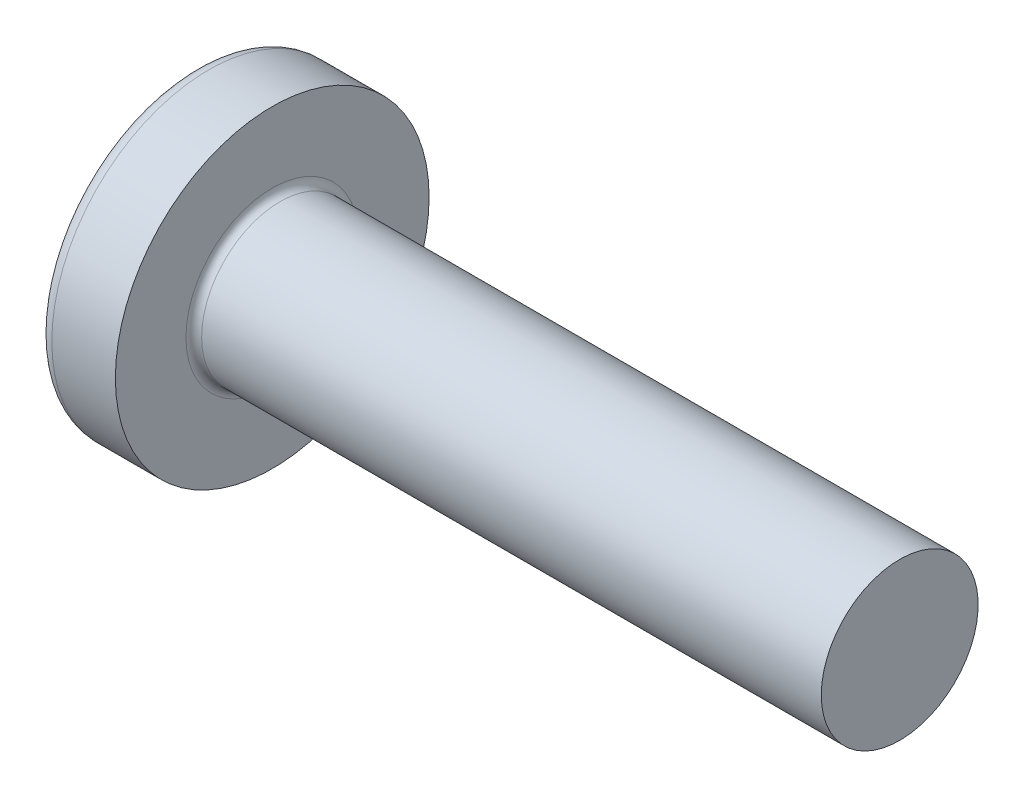
ISO-10303-21;
HEADER;
FILE_DESCRIPTION(('STEP AP214'),'2;1');
FILE_NAME('part.step','',(''),(''),'','','');
FILE_SCHEMA(('AUTOMOTIVE_DESIGN { 1 0 10303 214 1 1 1 1 }'));
ENDSEC;
DATA;
#1=APPLICATION_CONTEXT('core data for automotive mechanical design processes');
#2=APPLICATION_PROTOCOL_DEFINITION('international standard','automotive_design',2000,#1);
#3=PRODUCT_CONTEXT('',#1,'mechanical');
#4=PRODUCT('Part','Part','',(#3));
#5=PRODUCT_RELATED_PRODUCT_CATEGORY('part','',(#4));
#6=PRODUCT_DEFINITION_FORMATION('','',#4);
#7=PRODUCT_DEFINITION_CONTEXT('part definition',#1,'design');
#8=PRODUCT_DEFINITION('design','',#6,#7);
#9=PRODUCT_DEFINITION_SHAPE('','',#8);
#10=(LENGTH_UNIT() NAMED_UNIT(*) SI_UNIT(.MILLI.,.METRE.));
#11=(NAMED_UNIT(*) PLANE_ANGLE_UNIT() SI_UNIT($,.RADIAN.));
#12=(NAMED_UNIT(*) SI_UNIT($,.STERADIAN.) SOLID_ANGLE_UNIT());
#13=UNCERTAINTY_MEASURE_WITH_UNIT(LENGTH_MEASURE(1.E-05),#10,'distance_accuracy_value','');
#14=(GEOMETRIC_REPRESENTATION_CONTEXT(3) GLOBAL_UNCERTAINTY_ASSIGNED_CONTEXT((#13)) GLOBAL_UNIT_ASSIGNED_CONTEXT((#10,
#11,#12)) REPRESENTATION_CONTEXT('',''));
#15=CARTESIAN_POINT('',(0.,0.,0.));
#16=DIRECTION('',(0.,0.,1.));
#17=DIRECTION('',(1.,0.,0.));
#18=AXIS2_PLACEMENT_3D('',#15,#16,#17);
#19=CARTESIAN_POINT('',(3.2,0.,0.));
#20=DIRECTION('',(-1.,0.,0.));
#21=DIRECTION('',(0.,1.,0.));
#22=AXIS2_PLACEMENT_3D('',#19,#20,#21);
#23=SPHERICAL_SURFACE('',#22,3.2);
#24=CARTESIAN_POINT('',(0.646379599446113,0.,0.));
#25=DIRECTION('',(-1.,0.,0.));
#26=DIRECTION('',(0.,0.,1.));
#27=AXIS2_PLACEMENT_3D('',#24,#25,#26);
#28=CIRCLE('',#27,1.92847682119205);
#29=CARTESIAN_POINT('',(0.646379599446113,0.,1.92847682119205));
#30=VERTEX_POINT('',#29);
#31=EDGE_CURVE('E239',#30,#30,#28,.T.);
#32=ORIENTED_EDGE('',*,*,#31,.T.);
#33=EDGE_LOOP('',(#32));
#34=FACE_BOUND('',#33,.T.);
#35=CARTESIAN_POINT('',(0.0321614467928863,0.,0.));
#36=DIRECTION('',(1.,0.,0.));
#37=DIRECTION('',(0.,0.,-1.));
#38=AXIS2_PLACEMENT_3D('',#35,#36,#37);
#39=CIRCLE('',#38,0.452547125518057);
#40=CARTESIAN_POINT('',(0.0321614467928857,-0.239999999999999,-0.38366508938742));
#41=VERTEX_POINT('',#40);
#42=CARTESIAN_POINT('',(0.0321614467928861,-0.383665089387422,-0.24));
#43=VERTEX_POINT('',#42);
#44=EDGE_CURVE('E375',#41,#43,#39,.F.);
#45=ORIENTED_EDGE('',*,*,#44,.F.);
#46=CARTESIAN_POINT('',(3.2,-0.24,0.));
#47=DIRECTION('',(0.,1.,0.));
#48=DIRECTION('',(0.,0.,1.));
#49=AXIS2_PLACEMENT_3D('',#46,#47,#48);
#50=CIRCLE('',#49,3.19098730802866);
#51=CARTESIAN_POINT('',(0.160076670449441,-0.239999999999996,-0.970188718989376));
#52=VERTEX_POINT('',#51);
#53=EDGE_CURVE('E301',#52,#41,#50,.T.);
#54=ORIENTED_EDGE('',*,*,#53,.F.);
#55=CARTESIAN_POINT('',(2.98218770632418,0.,0.436863890831905));
#56=DIRECTION('',(0.446197800778958,0.,-0.89493436774996));
#57=DIRECTION('',(-0.89493436774996,0.,-0.446197800778958));
#58=AXIS2_PLACEMENT_3D('',#55,#56,#57);
#59=CIRCLE('',#58,3.16254766693103);
#60=CARTESIAN_POINT('',(0.160076670449441,0.240000000000003,-0.970188718989374));
#61=VERTEX_POINT('',#60);
#62=EDGE_CURVE('E273',#52,#61,#59,.T.);
#63=ORIENTED_EDGE('',*,*,#62,.T.);
#64=CARTESIAN_POINT('',(3.2,0.24,0.));
#65=DIRECTION('',(0.,-1.,0.));
#66=DIRECTION('',(0.,0.,-1.));
#67=AXIS2_PLACEMENT_3D('',#64,#65,#66);
#68=CIRCLE('',#67,3.19098730802866);
#69=CARTESIAN_POINT('',(0.0321614467928856,0.240000000000001,-0.383665089387418));
#70=VERTEX_POINT('',#69);
#71=EDGE_CURVE('E328',#70,#61,#68,.T.);
#72=ORIENTED_EDGE('',*,*,#71,.F.);
#73=CARTESIAN_POINT('',(0.0321614467928861,0.38366508938742,-0.24));
#74=VERTEX_POINT('',#73);
#75=EDGE_CURVE('E394',#74,#70,#39,.F.);
#76=ORIENTED_EDGE('',*,*,#75,.F.);
#77=CARTESIAN_POINT('',(3.2,0.,-0.24));
#78=DIRECTION('',(0.,0.,1.));
#79=DIRECTION('',(1.,0.,0.));
#80=AXIS2_PLACEMENT_3D('',#77,#78,#79);
#81=CIRCLE('',#80,3.19098730802866);
#82=CARTESIAN_POINT('',(0.160076670449441,0.970188718989374,-0.24));
#83=VERTEX_POINT('',#82);
#84=EDGE_CURVE('E267',#83,#74,#81,.T.);
#85=ORIENTED_EDGE('',*,*,#84,.F.);
#86=CARTESIAN_POINT('',(2.98218770632419,-0.436863890831905,0.));
#87=DIRECTION('',(0.446197800778958,0.89493436774996,0.));
#88=DIRECTION('',(-0.89493436774996,0.446197800778958,0.));
#89=AXIS2_PLACEMENT_3D('',#86,#87,#88);
#90=CIRCLE('',#89,3.16254766693103);
#91=CARTESIAN_POINT('',(0.160076670449442,0.970188718989374,0.24));
#92=VERTEX_POINT('',#91);
#93=EDGE_CURVE('E270',#83,#92,#90,.T.);
#94=ORIENTED_EDGE('',*,*,#93,.T.);
#95=CARTESIAN_POINT('',(3.2,0.,0.24));
#96=DIRECTION('',(0.,0.,-1.));
#97=DIRECTION('',(0.,1.,0.));
#98=AXIS2_PLACEMENT_3D('',#95,#96,#97);
#99=CIRCLE('',#98,3.19098730802866);
#100=CARTESIAN_POINT('',(0.0321614467928861,0.38366508938742,0.24));
#101=VERTEX_POINT('',#100);
#102=EDGE_CURVE('E263',#101,#92,#99,.T.);
#103=ORIENTED_EDGE('',*,*,#102,.F.);
#104=CARTESIAN_POINT('',(0.0321614467928857,0.239999999999999,0.38366508938742));
#105=VERTEX_POINT('',#104);
#106=EDGE_CURVE('E393',#105,#101,#39,.F.);
#107=ORIENTED_EDGE('',*,*,#106,.F.);
#108=CARTESIAN_POINT('',(0.160076670449441,0.239999999999997,0.970188718989375));
#109=VERTEX_POINT('',#108);
#110=EDGE_CURVE('E283',#109,#105,#68,.T.);
#111=ORIENTED_EDGE('',*,*,#110,.F.);
#112=CARTESIAN_POINT('',(2.98218770632418,0.,-0.436863890831904));
#113=DIRECTION('',(0.446197800778958,0.,0.89493436774996));
#114=DIRECTION('',(0.89493436774996,0.,-0.446197800778958));
#115=AXIS2_PLACEMENT_3D('',#112,#113,#114);
#116=CIRCLE('',#115,3.16254766693103);
#117=CARTESIAN_POINT('',(0.160076670449441,-0.240000000000003,0.970188718989374));
#118=VERTEX_POINT('',#117);
#119=EDGE_CURVE('E50',#109,#118,#116,.T.);
#120=ORIENTED_EDGE('',*,*,#119,.T.);
#121=CARTESIAN_POINT('',(0.0321614467928858,-0.240000000000001,0.383665089387418));
#122=VERTEX_POINT('',#121);
#123=EDGE_CURVE('E280',#122,#118,#50,.T.);
#124=ORIENTED_EDGE('',*,*,#123,.F.);
#125=CARTESIAN_POINT('',(0.0321614467928861,-0.383665089387422,0.24));
#126=VERTEX_POINT('',#125);
#127=EDGE_CURVE('E429',#126,#122,#39,.F.);
#128=ORIENTED_EDGE('',*,*,#127,.F.);
#129=CARTESIAN_POINT('',(0.160076670449441,-0.970188718989375,0.24));
#130=VERTEX_POINT('',#129);
#131=EDGE_CURVE('E264',#130,#126,#99,.T.);
#132=ORIENTED_EDGE('',*,*,#131,.F.);
#133=CARTESIAN_POINT('',(2.98218770632418,0.436863890831904,0.));
#134=DIRECTION('',(0.446197800778958,-0.89493436774996,0.));
#135=DIRECTION('',(0.89493436774996,0.446197800778958,0.));
#136=AXIS2_PLACEMENT_3D('',#133,#134,#135);
#137=CIRCLE('',#136,3.16254766693103);
#138=CARTESIAN_POINT('',(0.160076670449441,-0.970188718989375,-0.24));
#139=VERTEX_POINT('',#138);
#140=EDGE_CURVE('E260',#130,#139,#137,.T.);
#141=ORIENTED_EDGE('',*,*,#140,.T.);
#142=EDGE_CURVE('E65',#43,#139,#81,.T.);
#143=ORIENTED_EDGE('',*,*,#142,.F.);
#144=EDGE_LOOP('',(#45,#54,#63,#72,#76,#85,#94,#103,#107,#111,#120,#124,#128,#132,#141,#143));
#145=FACE_BOUND('',#144,.T.);
#146=ADVANCED_FACE('F37',(#34,#145),#23,.T.);
#147=CARTESIAN_POINT('',(1.42,0.342014140993248,-0.24));
#148=DIRECTION('',(0.,0.,1.));
#149=DIRECTION('',(1.,0.,0.));
#150=AXIS2_PLACEMENT_3D('',#147,#148,#149);
#151=PLANE('',#150);
#152=ORIENTED_EDGE('',*,*,#84,.T.);
#153=CARTESIAN_POINT('',(-0.626811087646333,0.437068483432734,-0.24));
#154=CARTESIAN_POINT('',(-0.489788496188268,0.426133650699674,-0.24));
#155=CARTESIAN_POINT('',(-0.35277275089666,0.415111501640762,-0.24));
#156=CARTESIAN_POINT('',(-0.078757882964478,0.392826208775377,-0.24));
#157=CARTESIAN_POINT('',(0.0582412392502161,0.381563059737591,-0.24));
#158=CARTESIAN_POINT('',(0.332213907654152,0.358729879929546,-0.24));
#159=CARTESIAN_POINT('',(0.469187453856035,0.347159849311357,-0.24));
#160=CARTESIAN_POINT('',(0.743097225439297,0.323608060039765,-0.24));
#161=CARTESIAN_POINT('',(0.880033451350377,0.311626307573655,-0.24));
#162=CARTESIAN_POINT('',(1.12503843743479,0.289667437089413,-0.24));
#163=CARTESIAN_POINT('',(1.23311691792,0.279799173776849,-0.24));
#164=CARTESIAN_POINT('',(1.4492267018282,0.259570129968442,-0.24));
#165=CARTESIAN_POINT('',(1.55725800577256,0.249209355061897,-0.24));
#166=CARTESIAN_POINT('',(1.77325939831777,0.227783788850472,-0.24));
#167=CARTESIAN_POINT('',(1.88122948205844,0.216718947894398,-0.24));
#168=CARTESIAN_POINT('',(2.04309848476113,0.199296215271932,-0.24));
#169=CARTESIAN_POINT('',(2.09704158415864,0.193350927204474,-0.24));
#170=CARTESIAN_POINT('',(2.20488609252136,0.181086542764125,-0.24));
#171=CARTESIAN_POINT('',(2.25878750075649,0.174767439988846,-0.24));
#172=CARTESIAN_POINT('',(2.31266102213859,0.168212174791089,-0.24));
#173=B_SPLINE_CURVE_WITH_KNOTS('',3,(#153,#154,#155,#156,#157,#158,#159,#160,#161,#162,#163,
#164,#165,#166,#167,#168,#169,#170,#171,#172),.UNSPECIFIED.,.F.,.F.,(4,2,2,2,2,2,2,2,2,4),(0.,
0.412374804430943,0.824758569256476,1.23714212973639,1.64951949568622,1.97510284899868,
2.30068250829037,2.62628515317116,2.78909323564388,2.95190410736571),.UNSPECIFIED.);
#174=CARTESIAN_POINT('',(1.42,0.262259890185289,-0.240000000000001));
#175=VERTEX_POINT('',#174);
#176=EDGE_CURVE('E415',#74,#175,#173,.T.);
#177=ORIENTED_EDGE('',*,*,#176,.T.);
#178=DIRECTION('',(0.,1.,0.));
#179=VECTOR('',#178,1.);
#180=CARTESIAN_POINT('',(1.42,-0.342014140993248,-0.24));
#181=LINE('',#180,#179);
#182=CARTESIAN_POINT('',(1.42,0.342014140993248,-0.24));
#183=VERTEX_POINT('',#182);
#184=EDGE_CURVE('E357',#175,#183,#181,.T.);
#185=ORIENTED_EDGE('',*,*,#184,.T.);
#186=DIRECTION('',(0.89493436774996,-0.446197800778958,0.));
#187=VECTOR('',#186,1.);
#188=CARTESIAN_POINT('',(0.,1.05,-0.24));
#189=LINE('',#188,#187);
#190=EDGE_CURVE('E240',#83,#183,#189,.T.);
#191=ORIENTED_EDGE('',*,*,#190,.F.);
#192=EDGE_LOOP('',(#152,#177,#185,#191));
#193=FACE_BOUND('',#192,.T.);
#194=ADVANCED_FACE('F195',(#193),#151,.T.);
#195=CARTESIAN_POINT('',(1.42,-0.342014140993248,-0.24));
#196=VERTEX_POINT('',#195);
#197=CARTESIAN_POINT('',(1.42,-0.262259890185289,-0.240000000000001));
#198=VERTEX_POINT('',#197);
#199=EDGE_CURVE('E248',#196,#198,#181,.T.);
#200=ORIENTED_EDGE('',*,*,#199,.T.);
#201=CARTESIAN_POINT('',(-0.626811087646333,-0.437068483432734,-0.24));
#202=CARTESIAN_POINT('',(-0.489788496188268,-0.426133650699674,-0.24));
#203=CARTESIAN_POINT('',(-0.35277275089666,-0.415111501640762,-0.24));
#204=CARTESIAN_POINT('',(-0.078757882964478,-0.392826208775377,-0.24));
#205=CARTESIAN_POINT('',(0.0582412392502161,-0.381563059737591,-0.24));
#206=CARTESIAN_POINT('',(0.332213907654152,-0.358729879929546,-0.24));
#207=CARTESIAN_POINT('',(0.469187453856035,-0.347159849311357,-0.24));
#208=CARTESIAN_POINT('',(0.743097225439297,-0.323608060039765,-0.24));
#209=CARTESIAN_POINT('',(0.880033451350377,-0.311626307573655,-0.24));
#210=CARTESIAN_POINT('',(1.12503843743479,-0.289667437089413,-0.24));
#211=CARTESIAN_POINT('',(1.23311691792,-0.279799173776849,-0.24));
#212=CARTESIAN_POINT('',(1.4492267018282,-0.259570129968442,-0.24));
#213=CARTESIAN_POINT('',(1.55725800577256,-0.249209355061897,-0.24));
#214=CARTESIAN_POINT('',(1.77325939831777,-0.227783788850472,-0.24));
#215=CARTESIAN_POINT('',(1.88122948205844,-0.216718947894398,-0.24));
#216=CARTESIAN_POINT('',(2.04309848476113,-0.199296215271932,-0.24));
#217=CARTESIAN_POINT('',(2.09704158415864,-0.193350927204474,-0.24));
#218=CARTESIAN_POINT('',(2.20488609252136,-0.181086542764125,-0.24));
#219=CARTESIAN_POINT('',(2.25878750075649,-0.174767439988846,-0.24));
#220=CARTESIAN_POINT('',(2.31266102213859,-0.168212174791089,-0.24));
#221=B_SPLINE_CURVE_WITH_KNOTS('',3,(#201,#202,#203,#204,#205,#206,#207,#208,#209,#210,#211,
#212,#213,#214,#215,#216,#217,#218,#219,#220),.UNSPECIFIED.,.F.,.F.,(4,2,2,2,2,2,2,2,2,4),(0.,
0.412374804430943,0.824758569256476,1.23714212973639,1.64951949568622,1.97510284899868,
2.30068250829037,2.62628515317116,2.78909323564388,2.95190410736571),.UNSPECIFIED.);
#222=EDGE_CURVE('E392',#198,#43,#221,.F.);
#223=ORIENTED_EDGE('',*,*,#222,.T.);
#224=ORIENTED_EDGE('',*,*,#142,.T.);
#225=DIRECTION('',(0.89493436774996,0.446197800778958,0.));
#226=VECTOR('',#225,1.);
#227=CARTESIAN_POINT('',(0.,-1.05,-0.24));
#228=LINE('',#227,#226);
#229=EDGE_CURVE('E331',#139,#196,#228,.T.);
#230=ORIENTED_EDGE('',*,*,#229,.T.);
#231=EDGE_LOOP('',(#200,#223,#224,#230));
#232=FACE_BOUND('',#231,.T.);
#233=ADVANCED_FACE('F201',(#232),#151,.T.);
#234=CARTESIAN_POINT('',(1.42,-0.342014140993248,0.24));
#235=DIRECTION('',(0.,0.,-1.));
#236=DIRECTION('',(0.,1.,0.));
#237=AXIS2_PLACEMENT_3D('',#234,#235,#236);
#238=PLANE('',#237);
#239=DIRECTION('',(0.,-1.,0.));
#240=VECTOR('',#239,1.);
#241=CARTESIAN_POINT('',(1.42,0.342014140993248,0.24));
#242=LINE('',#241,#240);
#243=CARTESIAN_POINT('',(1.42,0.342014140993248,0.24));
#244=VERTEX_POINT('',#243);
#245=CARTESIAN_POINT('',(1.42,0.262259890185289,0.240000000000001));
#246=VERTEX_POINT('',#245);
#247=EDGE_CURVE('E340',#244,#246,#242,.T.);
#248=ORIENTED_EDGE('',*,*,#247,.T.);
#249=CARTESIAN_POINT('',(-0.626811087646333,0.437068483432734,0.24));
#250=CARTESIAN_POINT('',(-0.489788496188268,0.426133650699674,0.24));
#251=CARTESIAN_POINT('',(-0.35277275089666,0.415111501640762,0.24));
#252=CARTESIAN_POINT('',(-0.078757882964478,0.392826208775377,0.24));
#253=CARTESIAN_POINT('',(0.0582412392502161,0.381563059737591,0.24));
#254=CARTESIAN_POINT('',(0.332213907654152,0.358729879929546,0.24));
#255=CARTESIAN_POINT('',(0.469187453856035,0.347159849311357,0.24));
#256=CARTESIAN_POINT('',(0.743097225439297,0.323608060039765,0.24));
#257=CARTESIAN_POINT('',(0.880033451350377,0.311626307573655,0.24));
#258=CARTESIAN_POINT('',(1.12503843743479,0.289667437089413,0.24));
#259=CARTESIAN_POINT('',(1.23311691792,0.279799173776849,0.24));
#260=CARTESIAN_POINT('',(1.4492267018282,0.259570129968442,0.24));
#261=CARTESIAN_POINT('',(1.55725800577256,0.249209355061897,0.24));
#262=CARTESIAN_POINT('',(1.77325939831777,0.227783788850472,0.24));
#263=CARTESIAN_POINT('',(1.88122948205844,0.216718947894398,0.24));
#264=CARTESIAN_POINT('',(2.04309848476113,0.199296215271932,0.24));
#265=CARTESIAN_POINT('',(2.09704158415864,0.193350927204474,0.24));
#266=CARTESIAN_POINT('',(2.20488609252136,0.181086542764125,0.24));
#267=CARTESIAN_POINT('',(2.25878750075649,0.174767439988846,0.24));
#268=CARTESIAN_POINT('',(2.31266102213859,0.168212174791089,0.24));
#269=B_SPLINE_CURVE_WITH_KNOTS('',3,(#249,#250,#251,#252,#253,#254,#255,#256,#257,#258,#259,
#260,#261,#262,#263,#264,#265,#266,#267,#268),.UNSPECIFIED.,.F.,.F.,(4,2,2,2,2,2,2,2,2,4),(0.,
0.412374804430943,0.824758569256476,1.23714212973639,1.64951949568622,1.97510284899868,
2.30068250829037,2.62628515317116,2.78909323564388,2.95190410736571),.UNSPECIFIED.);
#270=EDGE_CURVE('E665',#246,#101,#269,.F.);
#271=ORIENTED_EDGE('',*,*,#270,.T.);
#272=ORIENTED_EDGE('',*,*,#102,.T.);
#273=DIRECTION('',(0.89493436774996,-0.446197800778958,0.));
#274=VECTOR('',#273,1.);
#275=CARTESIAN_POINT('',(0.,1.05,0.24));
#276=LINE('',#275,#274);
#277=EDGE_CURVE('E245',#92,#244,#276,.T.);
#278=ORIENTED_EDGE('',*,*,#277,.T.);
#279=EDGE_LOOP('',(#248,#271,#272,#278));
#280=FACE_BOUND('',#279,.T.);
#281=ADVANCED_FACE('F411',(#280),#238,.T.);
#282=ORIENTED_EDGE('',*,*,#131,.T.);
#283=CARTESIAN_POINT('',(-0.62681108769363,-0.437068483436507,0.24));
#284=CARTESIAN_POINT('',(-0.489788496230297,-0.426133650703048,0.24));
#285=CARTESIAN_POINT('',(-0.352772750933422,-0.415111501643733,0.24));
#286=CARTESIAN_POINT('',(-0.078757882990706,-0.392826208777529,0.24));
#287=CARTESIAN_POINT('',(0.0582412392292549,-0.381563059739326,0.24));
#288=CARTESIAN_POINT('',(0.332213907649304,-0.358729879929962,0.24));
#289=CARTESIAN_POINT('',(0.46918745386203,-0.347159849310859,0.24));
#290=CARTESIAN_POINT('',(0.743097225466975,-0.323608060037368,0.24));
#291=CARTESIAN_POINT('',(0.880033451388893,-0.311626307570274,0.24));
#292=CARTESIAN_POINT('',(1.12503843748414,-0.289667437084935,0.24));
#293=CARTESIAN_POINT('',(1.23311691796934,-0.279799173772307,0.24));
#294=CARTESIAN_POINT('',(1.44922670187753,-0.259570129963748,0.24));
#295=CARTESIAN_POINT('',(1.55725800582188,-0.249209355057115,0.24));
#296=CARTESIAN_POINT('',(1.77325939836707,-0.227783788845471,0.24));
#297=CARTESIAN_POINT('',(1.88122948210773,-0.216718947889267,0.24));
#298=CARTESIAN_POINT('',(2.0430984848104,-0.199296215266543,0.24));
#299=CARTESIAN_POINT('',(2.0970415842079,-0.193350927198989,0.24));
#300=CARTESIAN_POINT('',(2.20488609257059,-0.181086542758414,0.24));
#301=CARTESIAN_POINT('',(2.25878750080571,-0.174767439983005,0.24));
#302=CARTESIAN_POINT('',(2.31266102218779,-0.168212174785095,0.24));
#303=B_SPLINE_CURVE_WITH_KNOTS('',3,(#283,#284,#285,#286,#287,#288,#289,#290,#291,#292,#293,
#294,#295,#296,#297,#298,#299,#300,#301,#302),.UNSPECIFIED.,.F.,.F.,(4,2,2,2,2,2,2,2,2,4),(0.,
0.41237480444679,0.824758569288173,1.23714212980074,1.64951949578321,1.97510284909568,
2.30068250838736,2.62628515326816,2.78909323574088,2.95190410746272),.UNSPECIFIED.);
#304=CARTESIAN_POINT('',(1.42,-0.262259890185289,0.240000000000001));
#305=VERTEX_POINT('',#304);
#306=EDGE_CURVE('E430',#126,#305,#303,.T.);
#307=ORIENTED_EDGE('',*,*,#306,.T.);
#308=CARTESIAN_POINT('',(1.42,-0.342014140993248,0.24));
#309=VERTEX_POINT('',#308);
#310=EDGE_CURVE('E342',#305,#309,#242,.T.);
#311=ORIENTED_EDGE('',*,*,#310,.T.);
#312=DIRECTION('',(0.89493436774996,0.446197800778958,0.));
#313=VECTOR('',#312,1.);
#314=CARTESIAN_POINT('',(0.,-1.05,0.24));
#315=LINE('',#314,#313);
#316=EDGE_CURVE('E333',#130,#309,#315,.T.);
#317=ORIENTED_EDGE('',*,*,#316,.F.);
#318=EDGE_LOOP('',(#282,#307,#311,#317));
#319=FACE_BOUND('',#318,.T.);
#320=ADVANCED_FACE('F521',(#319),#238,.T.);
#321=CARTESIAN_POINT('',(1.42,0.342014140993248,0.24));
#322=DIRECTION('',(0.446197800778958,0.89493436774996,0.));
#323=DIRECTION('',(-0.89493436774996,0.446197800778958,0.));
#324=AXIS2_PLACEMENT_3D('',#321,#322,#323);
#325=PLANE('',#324);
#326=CARTESIAN_POINT('',(2.01772939130752,0.0439972701774458,0.));
#327=DIRECTION('',(0.446197800778958,0.89493436774996,0.));
#328=DIRECTION('',(-0.89493436774996,0.446197800778958,0.));
#329=AXIS2_PLACEMENT_3D('',#326,#327,#328);
#330=ELLIPSE('',#329,0.703057452800713,0.310602024247227);
#331=CARTESIAN_POINT('',(1.42,0.342014140993249,0.0969875113643495));
#332=VERTEX_POINT('',#331);
#333=CARTESIAN_POINT('',(1.42,0.342014140993249,-0.0969875113643495));
#334=VERTEX_POINT('',#333);
#335=EDGE_CURVE('E306',#332,#334,#330,.F.);
#336=ORIENTED_EDGE('',*,*,#335,.F.);
#337=DIRECTION('',(0.,0.,-1.));
#338=VECTOR('',#337,1.);
#339=CARTESIAN_POINT('',(1.42,0.342014140993248,0.24));
#340=LINE('',#339,#338);
#341=EDGE_CURVE('E343',#244,#332,#340,.T.);
#342=ORIENTED_EDGE('',*,*,#341,.F.);
#343=ORIENTED_EDGE('',*,*,#277,.F.);
#344=ORIENTED_EDGE('',*,*,#93,.F.);
#345=ORIENTED_EDGE('',*,*,#190,.T.);
#346=EDGE_CURVE('E345',#334,#183,#340,.T.);
#347=ORIENTED_EDGE('',*,*,#346,.F.);
#348=EDGE_LOOP('',(#336,#342,#343,#344,#345,#347));
#349=FACE_BOUND('',#348,.T.);
#350=ADVANCED_FACE('F409',(#349),#325,.F.);
#351=CARTESIAN_POINT('',(0.,-1.05,-0.24));
#352=DIRECTION('',(0.446197800778958,-0.89493436774996,0.));
#353=DIRECTION('',(0.89493436774996,0.446197800778958,0.));
#354=AXIS2_PLACEMENT_3D('',#351,#352,#353);
#355=PLANE('',#354);
#356=CARTESIAN_POINT('',(2.01772939130752,-0.0439972701774458,0.));
#357=DIRECTION('',(0.446197800778958,-0.89493436774996,0.));
#358=DIRECTION('',(-0.89493436774996,-0.446197800778958,0.));
#359=AXIS2_PLACEMENT_3D('',#356,#357,#358);
#360=ELLIPSE('',#359,0.703057452800713,0.310602024247227);
#361=CARTESIAN_POINT('',(1.42,-0.342014140993249,-0.0969875113643494));
#362=VERTEX_POINT('',#361);
#363=CARTESIAN_POINT('',(1.42,-0.342014140993249,0.0969875113643493));
#364=VERTEX_POINT('',#363);
#365=EDGE_CURVE('E667',#362,#364,#360,.F.);
#366=ORIENTED_EDGE('',*,*,#365,.F.);
#367=DIRECTION('',(0.,0.,1.));
#368=VECTOR('',#367,1.);
#369=CARTESIAN_POINT('',(1.42,-0.342014140993248,-0.24));
#370=LINE('',#369,#368);
#371=EDGE_CURVE('E336',#196,#362,#370,.T.);
#372=ORIENTED_EDGE('',*,*,#371,.F.);
#373=ORIENTED_EDGE('',*,*,#229,.F.);
#374=ORIENTED_EDGE('',*,*,#140,.F.);
#375=ORIENTED_EDGE('',*,*,#316,.T.);
#376=EDGE_CURVE('E339',#364,#309,#370,.T.);
#377=ORIENTED_EDGE('',*,*,#376,.F.);
#378=EDGE_LOOP('',(#366,#372,#373,#374,#375,#377));
#379=FACE_BOUND('',#378,.T.);
#380=ADVANCED_FACE('F508',(#379),#355,.F.);
#381=CARTESIAN_POINT('',(1.42,0.342014140993248,-0.24));
#382=DIRECTION('',(-1.,0.,0.));
#383=DIRECTION('',(0.,0.,1.));
#384=AXIS2_PLACEMENT_3D('',#381,#382,#383);
#385=PLANE('',#384);
#386=DIRECTION('',(0.,1.,0.));
#387=VECTOR('',#386,1.);
#388=CARTESIAN_POINT('',(1.42,-0.240000000000001,0.342014140993247));
#389=LINE('',#388,#387);
#390=CARTESIAN_POINT('',(1.42,-0.240000000000001,0.342014140993247));
#391=VERTEX_POINT('',#390);
#392=CARTESIAN_POINT('',(1.42,-0.0969875113643545,0.342014140993248));
#393=VERTEX_POINT('',#392);
#394=EDGE_CURVE('E321',#391,#393,#389,.T.);
#395=ORIENTED_EDGE('',*,*,#394,.T.);
#396=CARTESIAN_POINT('',(1.42,0.,0.));
#397=DIRECTION('',(-1.,0.,0.));
#398=DIRECTION('',(0.,0.,1.));
#399=AXIS2_PLACEMENT_3D('',#396,#397,#398);
#400=CIRCLE('',#399,0.3555);
#401=CARTESIAN_POINT('',(1.42,-0.240000000000001,0.262259890185289));
#402=VERTEX_POINT('',#401);
#403=EDGE_CURVE('E693',#402,#393,#400,.T.);
#404=ORIENTED_EDGE('',*,*,#403,.F.);
#405=DIRECTION('',(0.,0.,-1.));
#406=VECTOR('',#405,1.);
#407=CARTESIAN_POINT('',(1.42,-0.240000000000001,0.342014140993247));
#408=LINE('',#407,#406);
#409=EDGE_CURVE('E317',#391,#402,#408,.T.);
#410=ORIENTED_EDGE('',*,*,#409,.F.);
#411=EDGE_LOOP('',(#395,#404,#410));
#412=FACE_BOUND('',#411,.T.);
#413=ADVANCED_FACE('F465',(#412),#385,.T.);
#414=ORIENTED_EDGE('',*,*,#310,.F.);
#415=EDGE_CURVE('E698',#364,#305,#400,.T.);
#416=ORIENTED_EDGE('',*,*,#415,.F.);
#417=ORIENTED_EDGE('',*,*,#376,.T.);
#418=EDGE_LOOP('',(#414,#416,#417));
#419=FACE_BOUND('',#418,.T.);
#420=ADVANCED_FACE('F495',(#419),#385,.T.);
#421=ORIENTED_EDGE('',*,*,#371,.T.);
#422=EDGE_CURVE('E386',#198,#362,#400,.T.);
#423=ORIENTED_EDGE('',*,*,#422,.F.);
#424=ORIENTED_EDGE('',*,*,#199,.F.);
#425=EDGE_LOOP('',(#421,#423,#424));
#426=FACE_BOUND('',#425,.T.);
#427=ADVANCED_FACE('F489',(#426),#385,.T.);
#428=CARTESIAN_POINT('',(1.42,-0.239999999999999,-0.262259890185288));
#429=VERTEX_POINT('',#428);
#430=CARTESIAN_POINT('',(1.42,-0.239999999999999,-0.342014140993249));
#431=VERTEX_POINT('',#430);
#432=EDGE_CURVE('E320',#429,#431,#408,.T.);
#433=ORIENTED_EDGE('',*,*,#432,.F.);
#434=CARTESIAN_POINT('',(1.42,-0.0969875113643523,-0.342014140993248));
#435=VERTEX_POINT('',#434);
#436=EDGE_CURVE('E57',#435,#429,#400,.T.);
#437=ORIENTED_EDGE('',*,*,#436,.F.);
#438=DIRECTION('',(0.,-1.,0.));
#439=VECTOR('',#438,1.);
#440=CARTESIAN_POINT('',(1.42,0.240000000000001,-0.342014140993247));
#441=LINE('',#440,#439);
#442=EDGE_CURVE('E316',#435,#431,#441,.T.);
#443=ORIENTED_EDGE('',*,*,#442,.T.);
#444=EDGE_LOOP('',(#433,#437,#443));
#445=FACE_BOUND('',#444,.T.);
#446=ADVANCED_FACE('F381',(#445),#385,.T.);
#447=CARTESIAN_POINT('',(1.42,0.240000000000001,-0.342014140993247));
#448=VERTEX_POINT('',#447);
#449=CARTESIAN_POINT('',(1.42,0.0969875113643547,-0.342014140993248));
#450=VERTEX_POINT('',#449);
#451=EDGE_CURVE('E313',#448,#450,#441,.T.);
#452=ORIENTED_EDGE('',*,*,#451,.T.);
#453=CARTESIAN_POINT('',(1.42,0.240000000000001,-0.262259890185289));
#454=VERTEX_POINT('',#453);
#455=EDGE_CURVE('E385',#454,#450,#400,.T.);
#456=ORIENTED_EDGE('',*,*,#455,.F.);
#457=DIRECTION('',(0.,0.,1.));
#458=VECTOR('',#457,1.);
#459=CARTESIAN_POINT('',(1.42,0.240000000000001,-0.342014140993247));
#460=LINE('',#459,#458);
#461=EDGE_CURVE('E325',#448,#454,#460,.T.);
#462=ORIENTED_EDGE('',*,*,#461,.F.);
#463=EDGE_LOOP('',(#452,#456,#462));
#464=FACE_BOUND('',#463,.T.);
#465=ADVANCED_FACE('F477',(#464),#385,.T.);
#466=ORIENTED_EDGE('',*,*,#184,.F.);
#467=EDGE_CURVE('E682',#334,#175,#400,.T.);
#468=ORIENTED_EDGE('',*,*,#467,.F.);
#469=ORIENTED_EDGE('',*,*,#346,.T.);
#470=EDGE_LOOP('',(#466,#468,#469));
#471=FACE_BOUND('',#470,.T.);
#472=ADVANCED_FACE('F471',(#471),#385,.T.);
#473=ORIENTED_EDGE('',*,*,#341,.T.);
#474=EDGE_CURVE('E684',#246,#332,#400,.T.);
#475=ORIENTED_EDGE('',*,*,#474,.F.);
#476=ORIENTED_EDGE('',*,*,#247,.F.);
#477=EDGE_LOOP('',(#473,#475,#476));
#478=FACE_BOUND('',#477,.T.);
#479=ADVANCED_FACE('F463',(#478),#385,.T.);
#480=CARTESIAN_POINT('',(1.42,0.239999999999999,0.26225989018529));
#481=VERTEX_POINT('',#480);
#482=CARTESIAN_POINT('',(1.42,0.239999999999999,0.342014140993249));
#483=VERTEX_POINT('',#482);
#484=EDGE_CURVE('E298',#481,#483,#460,.T.);
#485=ORIENTED_EDGE('',*,*,#484,.F.);
#486=CARTESIAN_POINT('',(1.42,0.0969875113643521,0.342014140993249));
#487=VERTEX_POINT('',#486);
#488=EDGE_CURVE('E387',#487,#481,#400,.T.);
#489=ORIENTED_EDGE('',*,*,#488,.F.);
#490=EDGE_CURVE('E324',#487,#483,#389,.T.);
#491=ORIENTED_EDGE('',*,*,#490,.T.);
#492=EDGE_LOOP('',(#485,#489,#491));
#493=FACE_BOUND('',#492,.T.);
#494=ADVANCED_FACE('F457',(#493),#385,.T.);
#495=CARTESIAN_POINT('',(1.42,0.239999999999999,0.342014140993249));
#496=DIRECTION('',(0.,-1.,0.));
#497=DIRECTION('',(1.,0.,0.));
#498=AXIS2_PLACEMENT_3D('',#495,#496,#497);
#499=PLANE('',#498);
#500=ORIENTED_EDGE('',*,*,#110,.T.);
#501=CARTESIAN_POINT('',(-0.626811087646333,0.239999999999998,0.437068483432735));
#502=CARTESIAN_POINT('',(-0.489788496188268,0.239999999999999,0.426133650699675));
#503=CARTESIAN_POINT('',(-0.35277275089666,0.239999999999999,0.415111501640762));
#504=CARTESIAN_POINT('',(-0.0787578829644782,0.239999999999999,0.392826208775378));
#505=CARTESIAN_POINT('',(0.0582412392502159,0.239999999999999,0.381563059737592));
#506=CARTESIAN_POINT('',(0.332213907654153,0.239999999999999,0.358729879929547));
#507=CARTESIAN_POINT('',(0.469187453856035,0.239999999999999,0.347159849311358));
#508=CARTESIAN_POINT('',(0.743097225439297,0.239999999999999,0.323608060039766));
#509=CARTESIAN_POINT('',(0.880033451350377,0.239999999999999,0.311626307573656));
#510=CARTESIAN_POINT('',(1.12503843743479,0.239999999999999,0.289667437089414));
#511=CARTESIAN_POINT('',(1.23311691792,0.239999999999999,0.279799173776849));
#512=CARTESIAN_POINT('',(1.4492267018282,0.239999999999999,0.259570129968443));
#513=CARTESIAN_POINT('',(1.55725800577256,0.239999999999999,0.249209355061898));
#514=CARTESIAN_POINT('',(1.77325939831777,0.239999999999999,0.227783788850473));
#515=CARTESIAN_POINT('',(1.88122948205844,0.239999999999999,0.216718947894399));
#516=CARTESIAN_POINT('',(2.04309848476113,0.239999999999999,0.199296215271933));
#517=CARTESIAN_POINT('',(2.09704158415864,0.239999999999999,0.193350927204475));
#518=CARTESIAN_POINT('',(2.20488609252136,0.239999999999999,0.181086542764126));
#519=CARTESIAN_POINT('',(2.25878750075649,0.239999999999999,0.174767439988847));
#520=CARTESIAN_POINT('',(2.31266102213859,0.239999999999999,0.16821217479109));
#521=B_SPLINE_CURVE_WITH_KNOTS('',3,(#501,#502,#503,#504,#505,#506,#507,#508,#509,#510,#511,
#512,#513,#514,#515,#516,#517,#518,#519,#520),.UNSPECIFIED.,.F.,.F.,(4,2,2,2,2,2,2,2,2,4),(0.,
0.412374804430942,0.824758569256476,1.23714212973639,1.64951949568622,1.97510284899868,
2.30068250829037,2.62628515317116,2.78909323564388,2.95190410736571),.UNSPECIFIED.);
#522=EDGE_CURVE('E664',#105,#481,#521,.T.);
#523=ORIENTED_EDGE('',*,*,#522,.T.);
#524=ORIENTED_EDGE('',*,*,#484,.T.);
#525=DIRECTION('',(0.89493436774996,0.,-0.446197800778958));
#526=VECTOR('',#525,1.);
#527=CARTESIAN_POINT('',(0.,0.239999999999996,1.05));
#528=LINE('',#527,#526);
#529=EDGE_CURVE('E291',#109,#483,#528,.T.);
#530=ORIENTED_EDGE('',*,*,#529,.F.);
#531=EDGE_LOOP('',(#500,#523,#524,#530));
#532=FACE_BOUND('',#531,.T.);
#533=ADVANCED_FACE('F295',(#532),#499,.T.);
#534=CARTESIAN_POINT('',(1.42,-0.239999999999999,-0.342014140993249));
#535=DIRECTION('',(0.,1.,0.));
#536=DIRECTION('',(0.,0.,1.));
#537=AXIS2_PLACEMENT_3D('',#534,#535,#536);
#538=PLANE('',#537);
#539=ORIENTED_EDGE('',*,*,#409,.T.);
#540=CARTESIAN_POINT('',(-0.626811087646334,-0.240000000000002,0.437068483432733));
#541=CARTESIAN_POINT('',(-0.489788496188268,-0.240000000000001,0.426133650699673));
#542=CARTESIAN_POINT('',(-0.35277275089666,-0.240000000000001,0.415111501640761));
#543=CARTESIAN_POINT('',(-0.0787578829644779,-0.240000000000001,0.392826208775376));
#544=CARTESIAN_POINT('',(0.0582412392502161,-0.240000000000001,0.38156305973759));
#545=CARTESIAN_POINT('',(0.332213907654152,-0.240000000000001,0.358729879929545));
#546=CARTESIAN_POINT('',(0.469187453856034,-0.240000000000001,0.347159849311357));
#547=CARTESIAN_POINT('',(0.743097225439297,-0.240000000000001,0.323608060039764));
#548=CARTESIAN_POINT('',(0.880033451350377,-0.240000000000001,0.311626307573654));
#549=CARTESIAN_POINT('',(1.12503843743479,-0.240000000000001,0.289667437089413));
#550=CARTESIAN_POINT('',(1.23311691792,-0.240000000000001,0.279799173776848));
#551=CARTESIAN_POINT('',(1.4492267018282,-0.240000000000001,0.259570129968441));
#552=CARTESIAN_POINT('',(1.55725800577256,-0.240000000000001,0.249209355061896));
#553=CARTESIAN_POINT('',(1.77325939831777,-0.240000000000001,0.227783788850472));
#554=CARTESIAN_POINT('',(1.88122948205844,-0.240000000000001,0.216718947894398));
#555=CARTESIAN_POINT('',(2.04309848476113,-0.240000000000001,0.199296215271931));
#556=CARTESIAN_POINT('',(2.09704158415864,-0.240000000000001,0.193350927204474));
#557=CARTESIAN_POINT('',(2.20488609252136,-0.240000000000001,0.181086542764124));
#558=CARTESIAN_POINT('',(2.25878750075649,-0.240000000000001,0.174767439988845));
#559=CARTESIAN_POINT('',(2.31266102213859,-0.240000000000001,0.168212174791088));
#560=B_SPLINE_CURVE_WITH_KNOTS('',3,(#540,#541,#542,#543,#544,#545,#546,#547,#548,#549,#550,
#551,#552,#553,#554,#555,#556,#557,#558,#559),.UNSPECIFIED.,.F.,.F.,(4,2,2,2,2,2,2,2,2,4),(0.,
0.412374804430943,0.824758569256476,1.23714212973639,1.64951949568622,1.97510284899868,
2.30068250829037,2.62628515317116,2.78909323564388,2.95190410736571),.UNSPECIFIED.);
#561=EDGE_CURVE('E423',#402,#122,#560,.F.);
#562=ORIENTED_EDGE('',*,*,#561,.T.);
#563=ORIENTED_EDGE('',*,*,#123,.T.);
#564=DIRECTION('',(0.89493436774996,0.,-0.446197800778958));
#565=VECTOR('',#564,1.);
#566=CARTESIAN_POINT('',(0.,-0.240000000000004,1.05));
#567=LINE('',#566,#565);
#568=EDGE_CURVE('E293',#118,#391,#567,.T.);
#569=ORIENTED_EDGE('',*,*,#568,.T.);
#570=EDGE_LOOP('',(#539,#562,#563,#569));
#571=FACE_BOUND('',#570,.T.);
#572=ADVANCED_FACE('F230',(#571),#538,.T.);
#573=CARTESIAN_POINT('',(1.42,-0.240000000000001,0.342014140993247));
#574=DIRECTION('',(0.446197800778958,0.,0.89493436774996));
#575=DIRECTION('',(-0.89493436774996,0.,0.446197800778958));
#576=AXIS2_PLACEMENT_3D('',#573,#574,#575);
#577=PLANE('',#576);
#578=CARTESIAN_POINT('',(2.01772939130752,0.,0.0439972701774458));
#579=DIRECTION('',(0.446197800778958,0.,0.89493436774996));
#580=DIRECTION('',(-0.89493436774996,0.,0.446197800778958));
#581=AXIS2_PLACEMENT_3D('',#578,#579,#580);
#582=ELLIPSE('',#581,0.703057452800713,0.310602024247227);
#583=EDGE_CURVE('E421',#393,#487,#582,.F.);
#584=ORIENTED_EDGE('',*,*,#583,.F.);
#585=ORIENTED_EDGE('',*,*,#394,.F.);
#586=ORIENTED_EDGE('',*,*,#568,.F.);
#587=ORIENTED_EDGE('',*,*,#119,.F.);
#588=ORIENTED_EDGE('',*,*,#529,.T.);
#589=ORIENTED_EDGE('',*,*,#490,.F.);
#590=EDGE_LOOP('',(#584,#585,#586,#587,#588,#589));
#591=FACE_BOUND('',#590,.T.);
#592=ADVANCED_FACE('F289',(#591),#577,.F.);
#593=CARTESIAN_POINT('',(0.,0.240000000000004,-1.05));
#594=DIRECTION('',(0.446197800778958,0.,-0.89493436774996));
#595=DIRECTION('',(0.89493436774996,0.,0.446197800778958));
#596=AXIS2_PLACEMENT_3D('',#593,#594,#595);
#597=PLANE('',#596);
#598=CARTESIAN_POINT('',(2.01772939130752,0.,-0.0439972701774458));
#599=DIRECTION('',(0.446197800778958,0.,-0.89493436774996));
#600=DIRECTION('',(-0.89493436774996,0.,-0.446197800778958));
#601=AXIS2_PLACEMENT_3D('',#598,#599,#600);
#602=ELLIPSE('',#601,0.703057452800713,0.310602024247227);
#603=EDGE_CURVE('E379',#450,#435,#602,.F.);
#604=ORIENTED_EDGE('',*,*,#603,.F.);
#605=ORIENTED_EDGE('',*,*,#451,.F.);
#606=DIRECTION('',(0.89493436774996,0.,0.446197800778958));
#607=VECTOR('',#606,1.);
#608=CARTESIAN_POINT('',(0.,0.240000000000004,-1.05));
#609=LINE('',#608,#607);
#610=EDGE_CURVE('E303',#61,#448,#609,.T.);
#611=ORIENTED_EDGE('',*,*,#610,.F.);
#612=ORIENTED_EDGE('',*,*,#62,.F.);
#613=DIRECTION('',(0.89493436774996,0.,0.446197800778958));
#614=VECTOR('',#613,1.);
#615=CARTESIAN_POINT('',(0.,-0.239999999999996,-1.05));
#616=LINE('',#615,#614);
#617=EDGE_CURVE('E310',#52,#431,#616,.T.);
#618=ORIENTED_EDGE('',*,*,#617,.T.);
#619=ORIENTED_EDGE('',*,*,#442,.F.);
#620=EDGE_LOOP('',(#604,#605,#611,#612,#618,#619));
#621=FACE_BOUND('',#620,.T.);
#622=ADVANCED_FACE('F370',(#621),#597,.F.);
#623=ORIENTED_EDGE('',*,*,#461,.T.);
#624=CARTESIAN_POINT('',(-0.62681108769363,0.240000000000001,-0.437068483436506));
#625=CARTESIAN_POINT('',(-0.489788496230297,0.240000000000001,-0.426133650703047));
#626=CARTESIAN_POINT('',(-0.352772750933422,0.240000000000001,-0.415111501643732));
#627=CARTESIAN_POINT('',(-0.0787578829907061,0.240000000000001,-0.392826208777528));
#628=CARTESIAN_POINT('',(0.0582412392292548,0.240000000000001,-0.381563059739325));
#629=CARTESIAN_POINT('',(0.332213907649304,0.240000000000001,-0.358729879929961));
#630=CARTESIAN_POINT('',(0.46918745386203,0.240000000000001,-0.347159849310858));
#631=CARTESIAN_POINT('',(0.743097225466975,0.240000000000001,-0.323608060037367));
#632=CARTESIAN_POINT('',(0.880033451388893,0.240000000000001,-0.311626307570273));
#633=CARTESIAN_POINT('',(1.12503843748414,0.240000000000001,-0.289667437084934));
#634=CARTESIAN_POINT('',(1.23311691796933,0.240000000000001,-0.279799173772306));
#635=CARTESIAN_POINT('',(1.44922670187753,0.240000000000001,-0.259570129963747));
#636=CARTESIAN_POINT('',(1.55725800582188,0.240000000000001,-0.249209355057114));
#637=CARTESIAN_POINT('',(1.77325939836707,0.240000000000001,-0.22778378884547));
#638=CARTESIAN_POINT('',(1.88122948210773,0.240000000000001,-0.216718947889266));
#639=CARTESIAN_POINT('',(2.0430984848104,0.240000000000001,-0.199296215266542));
#640=CARTESIAN_POINT('',(2.0970415842079,0.240000000000001,-0.193350927198988));
#641=CARTESIAN_POINT('',(2.20488609257059,0.240000000000001,-0.181086542758413));
#642=CARTESIAN_POINT('',(2.25878750080571,0.240000000000001,-0.174767439983004));
#643=CARTESIAN_POINT('',(2.31266102218779,0.240000000000001,-0.168212174785094));
#644=B_SPLINE_CURVE_WITH_KNOTS('',3,(#624,#625,#626,#627,#628,#629,#630,#631,#632,#633,#634,
#635,#636,#637,#638,#639,#640,#641,#642,#643),.UNSPECIFIED.,.F.,.F.,(4,2,2,2,2,2,2,2,2,4),(0.,
0.41237480444679,0.824758569288173,1.23714212980074,1.64951949578321,1.97510284909568,
2.30068250838736,2.62628515326816,2.78909323574088,2.95190410746272),.UNSPECIFIED.);
#645=EDGE_CURVE('E366',#454,#70,#644,.F.);
#646=ORIENTED_EDGE('',*,*,#645,.T.);
#647=ORIENTED_EDGE('',*,*,#71,.T.);
#648=ORIENTED_EDGE('',*,*,#610,.T.);
#649=EDGE_LOOP('',(#623,#646,#647,#648));
#650=FACE_BOUND('',#649,.T.);
#651=ADVANCED_FACE('F228',(#650),#499,.T.);
#652=ORIENTED_EDGE('',*,*,#53,.T.);
#653=CARTESIAN_POINT('',(-0.626811087646333,-0.239999999999998,-0.437068483432735));
#654=CARTESIAN_POINT('',(-0.489788496188268,-0.239999999999998,-0.426133650699675));
#655=CARTESIAN_POINT('',(-0.35277275089666,-0.239999999999998,-0.415111501640762));
#656=CARTESIAN_POINT('',(-0.0787578829644779,-0.239999999999998,-0.392826208775378));
#657=CARTESIAN_POINT('',(0.0582412392502162,-0.239999999999999,-0.381563059737592));
#658=CARTESIAN_POINT('',(0.332213907654152,-0.239999999999999,-0.358729879929547));
#659=CARTESIAN_POINT('',(0.469187453856035,-0.239999999999999,-0.347159849311358));
#660=CARTESIAN_POINT('',(0.743097225439297,-0.239999999999999,-0.323608060039766));
#661=CARTESIAN_POINT('',(0.880033451350377,-0.239999999999999,-0.311626307573656));
#662=CARTESIAN_POINT('',(1.12503843743479,-0.239999999999999,-0.289667437089414));
#663=CARTESIAN_POINT('',(1.23311691792,-0.239999999999999,-0.27979917377685));
#664=CARTESIAN_POINT('',(1.4492267018282,-0.239999999999999,-0.259570129968443));
#665=CARTESIAN_POINT('',(1.55725800577256,-0.239999999999999,-0.249209355061898));
#666=CARTESIAN_POINT('',(1.77325939831777,-0.239999999999999,-0.227783788850473));
#667=CARTESIAN_POINT('',(1.88122948205844,-0.239999999999999,-0.216718947894399));
#668=CARTESIAN_POINT('',(2.04309848476113,-0.239999999999999,-0.199296215271933));
#669=CARTESIAN_POINT('',(2.09704158415864,-0.239999999999999,-0.193350927204475));
#670=CARTESIAN_POINT('',(2.20488609252136,-0.239999999999999,-0.181086542764126));
#671=CARTESIAN_POINT('',(2.25878750075649,-0.239999999999999,-0.174767439988847));
#672=CARTESIAN_POINT('',(2.31266102213859,-0.239999999999999,-0.16821217479109));
#673=B_SPLINE_CURVE_WITH_KNOTS('',3,(#653,#654,#655,#656,#657,#658,#659,#660,#661,#662,#663,
#664,#665,#666,#667,#668,#669,#670,#671,#672),.UNSPECIFIED.,.F.,.F.,(4,2,2,2,2,2,2,2,2,4),(0.,
0.412374804430943,0.824758569256476,1.23714212973639,1.64951949568622,1.97510284899868,
2.30068250829037,2.62628515317116,2.78909323564388,2.95190410736571),.UNSPECIFIED.);
#674=EDGE_CURVE('E11',#41,#429,#673,.T.);
#675=ORIENTED_EDGE('',*,*,#674,.T.);
#676=ORIENTED_EDGE('',*,*,#432,.T.);
#677=ORIENTED_EDGE('',*,*,#617,.F.);
#678=EDGE_LOOP('',(#652,#675,#676,#677));
#679=FACE_BOUND('',#678,.T.);
#680=ADVANCED_FACE('F223',(#679),#538,.T.);
#681=CARTESIAN_POINT('',(-25.4,0.,0.));
#682=DIRECTION('',(-1.,0.,0.));
#683=DIRECTION('',(0.,0.,1.));
#684=AXIS2_PLACEMENT_3D('',#681,#682,#683);
#685=CYLINDRICAL_SURFACE('',#684,1.);
#686=CARTESIAN_POINT('',(1.7,0.,0.));
#687=DIRECTION('',(-1.,0.,0.));
#688=DIRECTION('',(0.,0.,1.));
#689=AXIS2_PLACEMENT_3D('',#686,#687,#688);
#690=CIRCLE('',#689,1.);
#691=CARTESIAN_POINT('',(1.7,0.,1.));
#692=VERTEX_POINT('',#691);
#693=EDGE_CURVE('E234',#692,#692,#690,.F.);
#694=ORIENTED_EDGE('',*,*,#693,.T.);
#695=EDGE_LOOP('',(#694));
#696=FACE_BOUND('',#695,.T.);
#697=CARTESIAN_POINT('',(9.6,0.,0.));
#698=DIRECTION('',(-1.,0.,0.));
#699=DIRECTION('',(0.,0.,1.));
#700=AXIS2_PLACEMENT_3D('',#697,#698,#699);
#701=CIRCLE('',#700,1.);
#702=CARTESIAN_POINT('',(9.6,0.,1.));
#703=VERTEX_POINT('',#702);
#704=EDGE_CURVE('E237',#703,#703,#701,.T.);
#705=ORIENTED_EDGE('',*,*,#704,.T.);
#706=EDGE_LOOP('',(#705));
#707=FACE_BOUND('',#706,.T.);
#708=ADVANCED_FACE('F220',(#696,#707),#685,.T.);
#709=CARTESIAN_POINT('',(1.6,1.,0.));
#710=DIRECTION('',(-1.,0.,0.));
#711=DIRECTION('',(0.,0.,1.));
#712=AXIS2_PLACEMENT_3D('',#709,#710,#711);
#713=PLANE('',#712);
#714=CARTESIAN_POINT('',(1.6,0.,0.));
#715=DIRECTION('',(-1.,0.,0.));
#716=DIRECTION('',(0.,0.,1.));
#717=AXIS2_PLACEMENT_3D('',#714,#715,#716);
#718=CIRCLE('',#717,1.1);
#719=CARTESIAN_POINT('',(1.6,0.,1.1));
#720=VERTEX_POINT('',#719);
#721=EDGE_CURVE('E256',#720,#720,#718,.T.);
#722=ORIENTED_EDGE('',*,*,#721,.T.);
#723=EDGE_LOOP('',(#722));
#724=FACE_BOUND('',#723,.T.);
#725=CARTESIAN_POINT('',(1.6,0.,0.));
#726=DIRECTION('',(-1.,0.,0.));
#727=DIRECTION('',(0.,0.,1.));
#728=AXIS2_PLACEMENT_3D('',#725,#726,#727);
#729=CIRCLE('',#728,2.);
#730=CARTESIAN_POINT('',(1.6,0.,2.));
#731=VERTEX_POINT('',#730);
#732=EDGE_CURVE('E253',#731,#731,#729,.T.);
#733=ORIENTED_EDGE('',*,*,#732,.F.);
#734=EDGE_LOOP('',(#733));
#735=FACE_BOUND('',#734,.T.);
#736=ADVANCED_FACE('F217',(#724,#735),#713,.F.);
#737=CARTESIAN_POINT('',(-25.4,0.,0.));
#738=DIRECTION('',(-1.,0.,0.));
#739=DIRECTION('',(0.,0.,1.));
#740=AXIS2_PLACEMENT_3D('',#737,#738,#739);
#741=CYLINDRICAL_SURFACE('',#740,2.);
#742=ORIENTED_EDGE('',*,*,#732,.T.);
#743=EDGE_LOOP('',(#742));
#744=FACE_BOUND('',#743,.T.);
#745=CARTESIAN_POINT('',(0.790020746977271,0.,0.));
#746=DIRECTION('',(-1.,0.,0.));
#747=DIRECTION('',(0.,0.,1.));
#748=AXIS2_PLACEMENT_3D('',#745,#746,#747);
#749=CIRCLE('',#748,2.);
#750=CARTESIAN_POINT('',(0.790020746977271,0.,2.));
#751=VERTEX_POINT('',#750);
#752=EDGE_CURVE('E242',#751,#751,#749,.T.);
#753=ORIENTED_EDGE('',*,*,#752,.F.);
#754=EDGE_LOOP('',(#753));
#755=FACE_BOUND('',#754,.T.);
#756=ADVANCED_FACE('F213',(#744,#755),#741,.T.);
#757=CARTESIAN_POINT('',(0.79002074697727,0.,0.));
#758=DIRECTION('',(-1.,0.,0.));
#759=DIRECTION('',(0.,0.,1.));
#760=AXIS2_PLACEMENT_3D('',#757,#758,#759);
#761=TOROIDAL_SURFACE('',#760,1.82,0.18);
#762=ORIENTED_EDGE('',*,*,#752,.T.);
#763=EDGE_LOOP('',(#762));
#764=FACE_BOUND('',#763,.T.);
#765=ORIENTED_EDGE('',*,*,#31,.F.);
#766=EDGE_LOOP('',(#765));
#767=FACE_BOUND('',#766,.T.);
#768=ADVANCED_FACE('F210',(#764,#767),#761,.T.);
#769=CARTESIAN_POINT('',(9.6,1.,0.));
#770=DIRECTION('',(1.,0.,0.));
#771=DIRECTION('',(0.,0.,-1.));
#772=AXIS2_PLACEMENT_3D('',#769,#770,#771);
#773=PLANE('',#772);
#774=ORIENTED_EDGE('',*,*,#704,.F.);
#775=EDGE_LOOP('',(#774));
#776=FACE_BOUND('',#775,.T.);
#777=ADVANCED_FACE('F208',(#776),#773,.T.);
#778=CARTESIAN_POINT('',(1.7,0.,0.));
#779=DIRECTION('',(-1.,0.,0.));
#780=DIRECTION('',(0.,0.,1.));
#781=AXIS2_PLACEMENT_3D('',#778,#779,#780);
#782=TOROIDAL_SURFACE('',#781,1.1,0.1);
#783=ORIENTED_EDGE('',*,*,#693,.F.);
#784=EDGE_LOOP('',(#783));
#785=FACE_BOUND('',#784,.T.);
#786=ORIENTED_EDGE('',*,*,#721,.F.);
#787=EDGE_LOOP('',(#786));
#788=FACE_BOUND('',#787,.T.);
#789=ADVANCED_FACE('F39',(#785,#788),#782,.F.);
#790=CARTESIAN_POINT('',(1.42,0.,0.));
#791=DIRECTION('',(-1.,0.,0.));
#792=DIRECTION('',(0.,0.,1.));
#793=AXIS2_PLACEMENT_3D('',#790,#791,#792);
#794=CONICAL_SURFACE('',#793,0.3555,0.069813170079766);
#795=ORIENTED_EDGE('',*,*,#335,.T.);
#796=EDGE_CURVE('E679',#332,#334,#400,.T.);
#797=ORIENTED_EDGE('',*,*,#796,.F.);
#798=EDGE_LOOP('',(#795,#797));
#799=FACE_BOUND('',#798,.T.);
#800=ADVANCED_FACE('F192',(#799),#794,.F.);
#801=ORIENTED_EDGE('',*,*,#365,.T.);
#802=EDGE_CURVE('E699',#362,#364,#400,.T.);
#803=ORIENTED_EDGE('',*,*,#802,.F.);
#804=EDGE_LOOP('',(#801,#803));
#805=FACE_BOUND('',#804,.T.);
#806=ADVANCED_FACE('F594',(#805),#794,.F.);
#807=EDGE_CURVE('E389',#481,#246,#400,.T.);
#808=ORIENTED_EDGE('',*,*,#807,.F.);
#809=ORIENTED_EDGE('',*,*,#522,.F.);
#810=ORIENTED_EDGE('',*,*,#106,.T.);
#811=ORIENTED_EDGE('',*,*,#270,.F.);
#812=EDGE_LOOP('',(#808,#809,#810,#811));
#813=FACE_BOUND('',#812,.T.);
#814=ADVANCED_FACE('F601',(#813),#794,.F.);
#815=ORIENTED_EDGE('',*,*,#583,.T.);
#816=EDGE_CURVE('E390',#393,#487,#400,.T.);
#817=ORIENTED_EDGE('',*,*,#816,.F.);
#818=EDGE_LOOP('',(#815,#817));
#819=FACE_BOUND('',#818,.T.);
#820=ADVANCED_FACE('F608',(#819),#794,.F.);
#821=ORIENTED_EDGE('',*,*,#603,.T.);
#822=EDGE_CURVE('E382',#450,#435,#400,.T.);
#823=ORIENTED_EDGE('',*,*,#822,.F.);
#824=EDGE_LOOP('',(#821,#823));
#825=FACE_BOUND('',#824,.T.);
#826=ADVANCED_FACE('F615',(#825),#794,.F.);
#827=ORIENTED_EDGE('',*,*,#127,.T.);
#828=ORIENTED_EDGE('',*,*,#561,.F.);
#829=EDGE_CURVE('E695',#305,#402,#400,.T.);
#830=ORIENTED_EDGE('',*,*,#829,.F.);
#831=ORIENTED_EDGE('',*,*,#306,.F.);
#832=EDGE_LOOP('',(#827,#828,#830,#831));
#833=FACE_BOUND('',#832,.T.);
#834=ADVANCED_FACE('F622',(#833),#794,.F.);
#835=ORIENTED_EDGE('',*,*,#75,.T.);
#836=ORIENTED_EDGE('',*,*,#645,.F.);
#837=EDGE_CURVE('E685',#175,#454,#400,.T.);
#838=ORIENTED_EDGE('',*,*,#837,.F.);
#839=ORIENTED_EDGE('',*,*,#176,.F.);
#840=EDGE_LOOP('',(#835,#836,#838,#839));
#841=FACE_BOUND('',#840,.T.);
#842=ADVANCED_FACE('F190',(#841),#794,.F.);
#843=EDGE_CURVE('E383',#429,#198,#400,.T.);
#844=ORIENTED_EDGE('',*,*,#843,.F.);
#845=ORIENTED_EDGE('',*,*,#674,.F.);
#846=ORIENTED_EDGE('',*,*,#44,.T.);
#847=ORIENTED_EDGE('',*,*,#222,.F.);
#848=EDGE_LOOP('',(#844,#845,#846,#847));
#849=FACE_BOUND('',#848,.T.);
#850=ADVANCED_FACE('F185',(#849),#794,.F.);
#851=CARTESIAN_POINT('',(1.5355089520108,0.,0.));
#852=DIRECTION('',(-1.,0.,0.));
#853=DIRECTION('',(0.,0.,1.));
#854=AXIS2_PLACEMENT_3D('',#851,#852,#853);
#855=CONICAL_SURFACE('',#854,0.,1.25663706143592);
#856=ORIENTED_EDGE('',*,*,#488,.T.);
#857=ORIENTED_EDGE('',*,*,#807,.T.);
#858=ORIENTED_EDGE('',*,*,#474,.T.);
#859=ORIENTED_EDGE('',*,*,#796,.T.);
#860=ORIENTED_EDGE('',*,*,#467,.T.);
#861=ORIENTED_EDGE('',*,*,#837,.T.);
#862=ORIENTED_EDGE('',*,*,#455,.T.);
#863=ORIENTED_EDGE('',*,*,#822,.T.);
#864=ORIENTED_EDGE('',*,*,#436,.T.);
#865=ORIENTED_EDGE('',*,*,#843,.T.);
#866=ORIENTED_EDGE('',*,*,#422,.T.);
#867=ORIENTED_EDGE('',*,*,#802,.T.);
#868=ORIENTED_EDGE('',*,*,#415,.T.);
#869=ORIENTED_EDGE('',*,*,#829,.T.);
#870=ORIENTED_EDGE('',*,*,#403,.T.);
#871=ORIENTED_EDGE('',*,*,#816,.T.);
#872=EDGE_LOOP('',(#856,#857,#858,#859,#860,#861,#862,#863,#864,#865,#866,#867,#868,#869,#870,#871));
#873=FACE_BOUND('',#872,.T.);
#874=CARTESIAN_POINT('',(1.5355089520108,0.,0.));
#875=VERTEX_POINT('',#874);
#876=VERTEX_LOOP('',#875);
#877=FACE_BOUND('',#876,.T.);
#878=ADVANCED_FACE('F183',(#873,#877),#855,.F.);
#879=CLOSED_SHELL('',(#146,#194,#233,#281,#320,#350,#380,#413,#420,#427,#446,#465,#472,#479,
#494,#533,#572,#592,#622,#651,#680,#708,#736,#756,#768,#777,#789,#800,#806,#814,#820,#826,#834,
#842,#850,#878));
#880=MANIFOLD_SOLID_BREP('B2',#879);
#881=ADVANCED_BREP_SHAPE_REPRESENTATION('',(#18,#880),#14);
#882=SHAPE_DEFINITION_REPRESENTATION(#9,#881);
ENDSEC;
END-ISO-10303-21;
